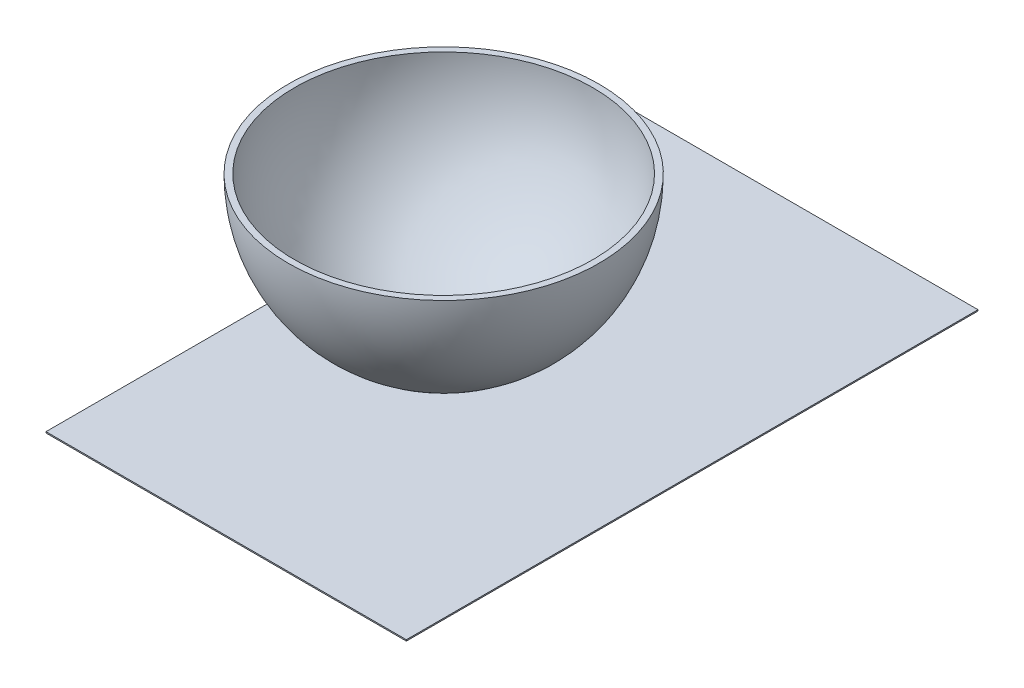
ISO-10303-21;
HEADER;
FILE_DESCRIPTION(('STEP AP214'),'2;1');
FILE_NAME('part.step','',(''),(''),'','','');
FILE_SCHEMA(('AUTOMOTIVE_DESIGN { 1 0 10303 214 1 1 1 1 }'));
ENDSEC;
DATA;
#1=APPLICATION_CONTEXT('core data for automotive mechanical design processes');
#2=APPLICATION_PROTOCOL_DEFINITION('international standard','automotive_design',2000,#1);
#3=PRODUCT_CONTEXT('',#1,'mechanical');
#4=PRODUCT('Part','Part','',(#3));
#5=PRODUCT_RELATED_PRODUCT_CATEGORY('part','',(#4));
#6=PRODUCT_DEFINITION_FORMATION('','',#4);
#7=PRODUCT_DEFINITION_CONTEXT('part definition',#1,'design');
#8=PRODUCT_DEFINITION('design','',#6,#7);
#9=PRODUCT_DEFINITION_SHAPE('','',#8);
#10=(LENGTH_UNIT() NAMED_UNIT(*) SI_UNIT(.MILLI.,.METRE.));
#11=(NAMED_UNIT(*) PLANE_ANGLE_UNIT() SI_UNIT($,.RADIAN.));
#12=(NAMED_UNIT(*) SI_UNIT($,.STERADIAN.) SOLID_ANGLE_UNIT());
#13=UNCERTAINTY_MEASURE_WITH_UNIT(LENGTH_MEASURE(1.E-05),#10,'distance_accuracy_value','');
#14=(GEOMETRIC_REPRESENTATION_CONTEXT(3) GLOBAL_UNCERTAINTY_ASSIGNED_CONTEXT((#13)) GLOBAL_UNIT_ASSIGNED_CONTEXT((#10,
#11,#12)) REPRESENTATION_CONTEXT('',''));
#15=CARTESIAN_POINT('',(0.,0.,0.));
#16=DIRECTION('',(0.,0.,1.));
#17=DIRECTION('',(1.,0.,0.));
#18=AXIS2_PLACEMENT_3D('',#15,#16,#17);
#19=CARTESIAN_POINT('',(-145.,-51.,-285.));
#20=DIRECTION('',(-1.,0.,0.));
#21=DIRECTION('',(0.,0.,1.));
#22=AXIS2_PLACEMENT_3D('',#19,#20,#21);
#23=PLANE('',#22);
#24=DIRECTION('',(0.,0.,1.));
#25=VECTOR('',#24,1.);
#26=CARTESIAN_POINT('',(-145.,-50.,-285.));
#27=LINE('',#26,#25);
#28=CARTESIAN_POINT('',(-145.,-50.,-285.));
#29=VERTEX_POINT('',#28);
#30=CARTESIAN_POINT('',(-145.,-50.,175.));
#31=VERTEX_POINT('',#30);
#32=EDGE_CURVE('E111',#29,#31,#27,.T.);
#33=ORIENTED_EDGE('',*,*,#32,.F.);
#34=DIRECTION('',(0.,1.,0.));
#35=VECTOR('',#34,1.);
#36=CARTESIAN_POINT('',(-145.,-51.,-285.));
#37=LINE('',#36,#35);
#38=CARTESIAN_POINT('',(-145.,-51.,-285.));
#39=VERTEX_POINT('',#38);
#40=EDGE_CURVE('E12',#39,#29,#37,.T.);
#41=ORIENTED_EDGE('',*,*,#40,.F.);
#42=DIRECTION('',(0.,0.,1.));
#43=VECTOR('',#42,1.);
#44=CARTESIAN_POINT('',(-145.,-51.,-285.));
#45=LINE('',#44,#43);
#46=CARTESIAN_POINT('',(-145.,-51.,175.));
#47=VERTEX_POINT('',#46);
#48=EDGE_CURVE('E105',#39,#47,#45,.T.);
#49=ORIENTED_EDGE('',*,*,#48,.T.);
#50=DIRECTION('',(0.,1.,0.));
#51=VECTOR('',#50,1.);
#52=CARTESIAN_POINT('',(-145.,-51.,175.));
#53=LINE('',#52,#51);
#54=EDGE_CURVE('E50',#47,#31,#53,.T.);
#55=ORIENTED_EDGE('',*,*,#54,.T.);
#56=EDGE_LOOP('',(#33,#41,#49,#55));
#57=FACE_BOUND('',#56,.T.);
#58=ADVANCED_FACE('F47',(#57),#23,.T.);
#59=CARTESIAN_POINT('',(-145.,-51.,-285.));
#60=DIRECTION('',(0.,0.,-1.));
#61=DIRECTION('',(-1.,0.,0.));
#62=AXIS2_PLACEMENT_3D('',#59,#60,#61);
#63=PLANE('',#62);
#64=DIRECTION('',(-1.,0.,0.));
#65=VECTOR('',#64,1.);
#66=CARTESIAN_POINT('',(-145.,-50.,-285.));
#67=LINE('',#66,#65);
#68=CARTESIAN_POINT('',(145.,-50.,-285.));
#69=VERTEX_POINT('',#68);
#70=EDGE_CURVE('E107',#69,#29,#67,.T.);
#71=ORIENTED_EDGE('',*,*,#70,.F.);
#72=DIRECTION('',(0.,1.,0.));
#73=VECTOR('',#72,1.);
#74=CARTESIAN_POINT('',(145.,-51.,-285.));
#75=LINE('',#74,#73);
#76=CARTESIAN_POINT('',(145.,-51.,-285.));
#77=VERTEX_POINT('',#76);
#78=EDGE_CURVE('E56',#77,#69,#75,.T.);
#79=ORIENTED_EDGE('',*,*,#78,.F.);
#80=DIRECTION('',(-1.,0.,0.));
#81=VECTOR('',#80,1.);
#82=CARTESIAN_POINT('',(-145.,-51.,-285.));
#83=LINE('',#82,#81);
#84=EDGE_CURVE('E102',#77,#39,#83,.T.);
#85=ORIENTED_EDGE('',*,*,#84,.T.);
#86=ORIENTED_EDGE('',*,*,#40,.T.);
#87=EDGE_LOOP('',(#71,#79,#85,#86));
#88=FACE_BOUND('',#87,.T.);
#89=ADVANCED_FACE('F121',(#88),#63,.T.);
#90=CARTESIAN_POINT('',(145.,-51.,-285.));
#91=DIRECTION('',(1.,0.,0.));
#92=DIRECTION('',(0.,0.,-1.));
#93=AXIS2_PLACEMENT_3D('',#90,#91,#92);
#94=PLANE('',#93);
#95=DIRECTION('',(0.,0.,-1.));
#96=VECTOR('',#95,1.);
#97=CARTESIAN_POINT('',(145.,-50.,-285.));
#98=LINE('',#97,#96);
#99=CARTESIAN_POINT('',(145.,-50.,175.));
#100=VERTEX_POINT('',#99);
#101=EDGE_CURVE('E97',#100,#69,#98,.T.);
#102=ORIENTED_EDGE('',*,*,#101,.F.);
#103=DIRECTION('',(0.,1.,0.));
#104=VECTOR('',#103,1.);
#105=CARTESIAN_POINT('',(145.,-51.,175.));
#106=LINE('',#105,#104);
#107=CARTESIAN_POINT('',(145.,-51.,175.));
#108=VERTEX_POINT('',#107);
#109=EDGE_CURVE('E92',#108,#100,#106,.T.);
#110=ORIENTED_EDGE('',*,*,#109,.F.);
#111=DIRECTION('',(0.,0.,-1.));
#112=VECTOR('',#111,1.);
#113=CARTESIAN_POINT('',(145.,-51.,-285.));
#114=LINE('',#113,#112);
#115=EDGE_CURVE('E95',#108,#77,#114,.T.);
#116=ORIENTED_EDGE('',*,*,#115,.T.);
#117=ORIENTED_EDGE('',*,*,#78,.T.);
#118=EDGE_LOOP('',(#102,#110,#116,#117));
#119=FACE_BOUND('',#118,.T.);
#120=ADVANCED_FACE('F94',(#119),#94,.T.);
#121=CARTESIAN_POINT('',(-145.,-51.,175.));
#122=DIRECTION('',(0.,0.,1.));
#123=DIRECTION('',(1.,0.,0.));
#124=AXIS2_PLACEMENT_3D('',#121,#122,#123);
#125=PLANE('',#124);
#126=DIRECTION('',(1.,0.,0.));
#127=VECTOR('',#126,1.);
#128=CARTESIAN_POINT('',(-145.,-50.,175.));
#129=LINE('',#128,#127);
#130=EDGE_CURVE('E114',#31,#100,#129,.T.);
#131=ORIENTED_EDGE('',*,*,#130,.F.);
#132=ORIENTED_EDGE('',*,*,#54,.F.);
#133=DIRECTION('',(1.,0.,0.));
#134=VECTOR('',#133,1.);
#135=CARTESIAN_POINT('',(-145.,-51.,175.));
#136=LINE('',#135,#134);
#137=EDGE_CURVE('E101',#47,#108,#136,.T.);
#138=ORIENTED_EDGE('',*,*,#137,.T.);
#139=ORIENTED_EDGE('',*,*,#109,.T.);
#140=EDGE_LOOP('',(#131,#132,#138,#139));
#141=FACE_BOUND('',#140,.T.);
#142=ADVANCED_FACE('F104',(#141),#125,.T.);
#143=CARTESIAN_POINT('',(0.,-51.,0.));
#144=DIRECTION('',(0.,1.,0.));
#145=DIRECTION('',(0.,0.,1.));
#146=AXIS2_PLACEMENT_3D('',#143,#144,#145);
#147=PLANE('',#146);
#148=ORIENTED_EDGE('',*,*,#48,.F.);
#149=ORIENTED_EDGE('',*,*,#84,.F.);
#150=ORIENTED_EDGE('',*,*,#115,.F.);
#151=ORIENTED_EDGE('',*,*,#137,.F.);
#152=EDGE_LOOP('',(#148,#149,#150,#151));
#153=FACE_BOUND('',#152,.T.);
#154=ADVANCED_FACE('F100',(#153),#147,.F.);
#155=CARTESIAN_POINT('',(0.,-50.,0.));
#156=DIRECTION('',(0.,1.,0.));
#157=DIRECTION('',(0.,0.,1.));
#158=AXIS2_PLACEMENT_3D('',#155,#156,#157);
#159=PLANE('',#158);
#160=ORIENTED_EDGE('',*,*,#32,.T.);
#161=ORIENTED_EDGE('',*,*,#130,.T.);
#162=ORIENTED_EDGE('',*,*,#101,.T.);
#163=ORIENTED_EDGE('',*,*,#70,.T.);
#164=EDGE_LOOP('',(#160,#161,#162,#163));
#165=FACE_BOUND('',#164,.T.);
#166=ADVANCED_FACE('F120',(#165),#159,.T.);
#167=CLOSED_SHELL('',(#58,#89,#120,#142,#154,#166));
#168=MANIFOLD_SOLID_BREP('B2',#167);
#169=CARTESIAN_POINT('',(0.,114.78240283249,0.));
#170=DIRECTION('',(0.,1.,0.));
#171=DIRECTION('',(0.,0.,1.));
#172=AXIS2_PLACEMENT_3D('',#169,#170,#171);
#173=PLANE('',#172);
#174=CARTESIAN_POINT('',(0.,114.78240283249,0.));
#175=DIRECTION('',(0.,-1.,0.));
#176=DIRECTION('',(0.,0.,-1.));
#177=AXIS2_PLACEMENT_3D('',#174,#175,#176);
#178=CIRCLE('',#177,125.);
#179=CARTESIAN_POINT('',(0.,114.78240283249,-125.));
#180=VERTEX_POINT('',#179);
#181=EDGE_CURVE('E46',#180,#180,#178,.T.);
#182=ORIENTED_EDGE('',*,*,#181,.F.);
#183=EDGE_LOOP('',(#182));
#184=FACE_BOUND('',#183,.T.);
#185=CARTESIAN_POINT('',(0.,114.78240283249,0.));
#186=DIRECTION('',(0.,-1.,0.));
#187=DIRECTION('',(0.,0.,-1.));
#188=AXIS2_PLACEMENT_3D('',#185,#186,#187);
#189=CIRCLE('',#188,120.);
#190=CARTESIAN_POINT('',(0.,114.78240283249,-120.));
#191=VERTEX_POINT('',#190);
#192=EDGE_CURVE('E195',#191,#191,#189,.T.);
#193=ORIENTED_EDGE('',*,*,#192,.T.);
#194=EDGE_LOOP('',(#193));
#195=FACE_BOUND('',#194,.T.);
#196=ADVANCED_FACE('F183',(#184,#195),#173,.T.);
#197=CARTESIAN_POINT('',(35.,-5.,0.));
#198=DIRECTION('',(0.,-1.,0.));
#199=DIRECTION('',(0.,0.,-1.));
#200=AXIS2_PLACEMENT_3D('',#197,#198,#199);
#201=PLANE('',#200);
#202=CARTESIAN_POINT('',(0.,-5.,0.));
#203=DIRECTION('',(0.,-1.,0.));
#204=DIRECTION('',(0.,0.,-1.));
#205=AXIS2_PLACEMENT_3D('',#202,#203,#204);
#206=CIRCLE('',#205,35.7375988515611);
#207=CARTESIAN_POINT('',(0.,-5.,-35.7375988515611));
#208=VERTEX_POINT('',#207);
#209=EDGE_CURVE('E190',#208,#208,#206,.T.);
#210=ORIENTED_EDGE('',*,*,#209,.T.);
#211=EDGE_LOOP('',(#210));
#212=FACE_BOUND('',#211,.T.);
#213=ADVANCED_FACE('F214',(#212),#201,.T.);
#214=CARTESIAN_POINT('',(0.,114.78240283249,0.));
#215=DIRECTION('',(0.,-1.,0.));
#216=DIRECTION('',(1.,0.,0.));
#217=AXIS2_PLACEMENT_3D('',#214,#215,#216);
#218=SPHERICAL_SURFACE('',#217,125.);
#219=ORIENTED_EDGE('',*,*,#181,.T.);
#220=EDGE_LOOP('',(#219));
#221=FACE_BOUND('',#220,.T.);
#222=ORIENTED_EDGE('',*,*,#209,.F.);
#223=EDGE_LOOP('',(#222));
#224=FACE_BOUND('',#223,.T.);
#225=ADVANCED_FACE('F207',(#221,#224),#218,.T.);
#226=CARTESIAN_POINT('',(35.,0.,0.));
#227=DIRECTION('',(0.,-1.,0.));
#228=DIRECTION('',(0.,0.,-1.));
#229=AXIS2_PLACEMENT_3D('',#226,#227,#228);
#230=PLANE('',#229);
#231=CARTESIAN_POINT('',(0.,0.,0.));
#232=DIRECTION('',(0.,-1.,0.));
#233=DIRECTION('',(0.,0.,-1.));
#234=AXIS2_PLACEMENT_3D('',#231,#232,#233);
#235=CIRCLE('',#234,35.);
#236=CARTESIAN_POINT('',(0.,0.,-35.));
#237=VERTEX_POINT('',#236);
#238=EDGE_CURVE('E186',#237,#237,#235,.T.);
#239=ORIENTED_EDGE('',*,*,#238,.F.);
#240=EDGE_LOOP('',(#239));
#241=FACE_BOUND('',#240,.T.);
#242=ADVANCED_FACE('F205',(#241),#230,.F.);
#243=CARTESIAN_POINT('',(0.,114.78240283249,0.));
#244=DIRECTION('',(0.,-1.,0.));
#245=DIRECTION('',(1.,0.,0.));
#246=AXIS2_PLACEMENT_3D('',#243,#244,#245);
#247=SPHERICAL_SURFACE('',#246,120.);
#248=ORIENTED_EDGE('',*,*,#192,.F.);
#249=EDGE_LOOP('',(#248));
#250=FACE_BOUND('',#249,.T.);
#251=ORIENTED_EDGE('',*,*,#238,.T.);
#252=EDGE_LOOP('',(#251));
#253=FACE_BOUND('',#252,.T.);
#254=ADVANCED_FACE('F203',(#250,#253),#247,.F.);
#255=CLOSED_SHELL('',(#196,#213,#225,#242,#254));
#256=MANIFOLD_SOLID_BREP('B6',#255);
#257=ADVANCED_BREP_SHAPE_REPRESENTATION('',(#18,#168,#256),#14);
#258=SHAPE_DEFINITION_REPRESENTATION(#9,#257);
ENDSEC;
END-ISO-10303-21;
